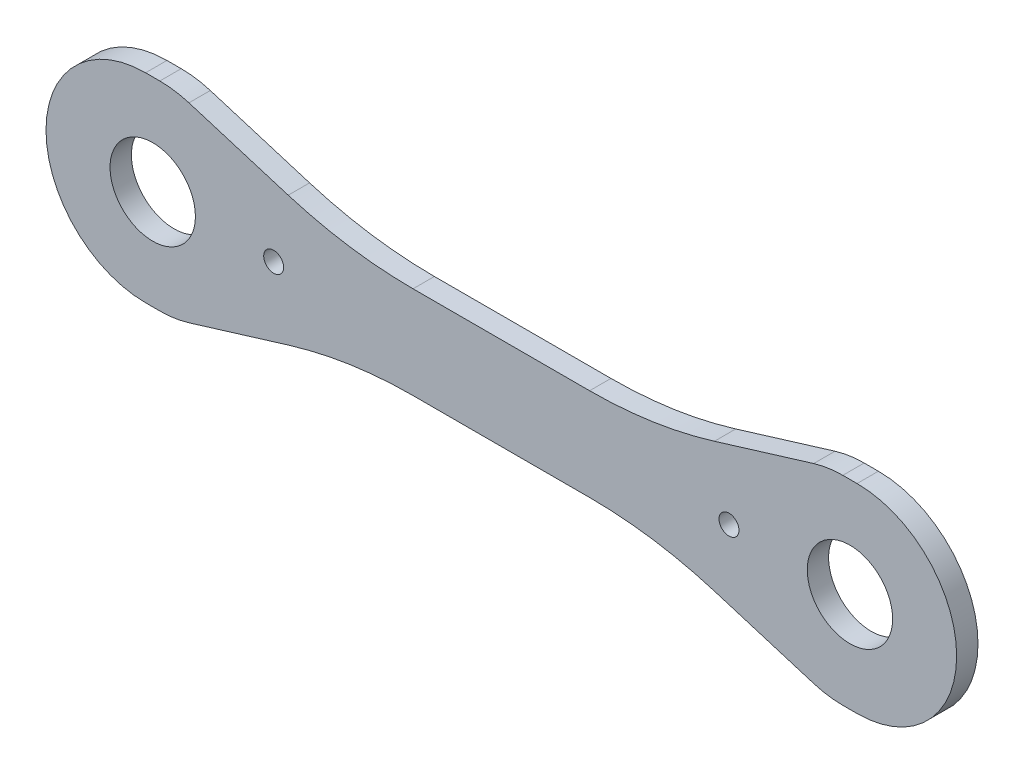
ISO-10303-21;
HEADER;
FILE_DESCRIPTION(('STEP AP214'),'2;1');
FILE_NAME('part.step','',(''),(''),'','','');
FILE_SCHEMA(('AUTOMOTIVE_DESIGN { 1 0 10303 214 1 1 1 1 }'));
ENDSEC;
DATA;
#1=APPLICATION_CONTEXT('core data for automotive mechanical design processes');
#2=APPLICATION_PROTOCOL_DEFINITION('international standard','automotive_design',2000,#1);
#3=PRODUCT_CONTEXT('',#1,'mechanical');
#4=PRODUCT('Part','Part','',(#3));
#5=PRODUCT_RELATED_PRODUCT_CATEGORY('part','',(#4));
#6=PRODUCT_DEFINITION_FORMATION('','',#4);
#7=PRODUCT_DEFINITION_CONTEXT('part definition',#1,'design');
#8=PRODUCT_DEFINITION('design','',#6,#7);
#9=PRODUCT_DEFINITION_SHAPE('','',#8);
#10=(LENGTH_UNIT() NAMED_UNIT(*) SI_UNIT(.MILLI.,.METRE.));
#11=(NAMED_UNIT(*) PLANE_ANGLE_UNIT() SI_UNIT($,.RADIAN.));
#12=(NAMED_UNIT(*) SI_UNIT($,.STERADIAN.) SOLID_ANGLE_UNIT());
#13=UNCERTAINTY_MEASURE_WITH_UNIT(LENGTH_MEASURE(1.E-05),#10,'distance_accuracy_value','');
#14=(GEOMETRIC_REPRESENTATION_CONTEXT(3) GLOBAL_UNCERTAINTY_ASSIGNED_CONTEXT((#13)) GLOBAL_UNIT_ASSIGNED_CONTEXT((#10,
#11,#12)) REPRESENTATION_CONTEXT('',''));
#15=CARTESIAN_POINT('',(0.,0.,0.));
#16=DIRECTION('',(0.,0.,1.));
#17=DIRECTION('',(1.,0.,0.));
#18=AXIS2_PLACEMENT_3D('',#15,#16,#17);
#19=CARTESIAN_POINT('',(-250.,0.,14.9999999999997));
#20=DIRECTION('',(0.,0.,-1.));
#21=DIRECTION('',(-1.,0.,0.));
#22=AXIS2_PLACEMENT_3D('',#19,#20,#21);
#23=CYLINDRICAL_SURFACE('',#22,70.);
#24=CARTESIAN_POINT('',(-250.,1.11022302462516E-13,-1.11022302462516E-13));
#25=DIRECTION('',(0.,0.,1.));
#26=DIRECTION('',(1.,0.,0.));
#27=AXIS2_PLACEMENT_3D('',#24,#25,#26);
#28=CIRCLE('',#27,70.);
#29=CARTESIAN_POINT('',(-250.,70.0000000000003,-1.11022302462516E-13));
#30=VERTEX_POINT('',#29);
#31=CARTESIAN_POINT('',(-250.,-70.0000000000001,-1.66533453693773E-13));
#32=VERTEX_POINT('',#31);
#33=EDGE_CURVE('E200',#30,#32,#28,.T.);
#34=ORIENTED_EDGE('',*,*,#33,.T.);
#35=DIRECTION('',(0.,0.,-1.));
#36=VECTOR('',#35,1.);
#37=CARTESIAN_POINT('',(-250.,-70.,14.9999999999997));
#38=LINE('',#37,#36);
#39=CARTESIAN_POINT('',(-250.,-70.,14.9999999999997));
#40=VERTEX_POINT('',#39);
#41=EDGE_CURVE('E11',#40,#32,#38,.T.);
#42=ORIENTED_EDGE('',*,*,#41,.F.);
#43=CARTESIAN_POINT('',(-250.,0.,14.9999999999997));
#44=DIRECTION('',(0.,0.,1.));
#45=DIRECTION('',(1.,0.,0.));
#46=AXIS2_PLACEMENT_3D('',#43,#44,#45);
#47=CIRCLE('',#46,70.);
#48=CARTESIAN_POINT('',(-250.,70.0000000000003,15.));
#49=VERTEX_POINT('',#48);
#50=EDGE_CURVE('E239',#49,#40,#47,.T.);
#51=ORIENTED_EDGE('',*,*,#50,.F.);
#52=DIRECTION('',(0.,0.,-1.));
#53=VECTOR('',#52,1.);
#54=CARTESIAN_POINT('',(-250.,70.0000000000003,15.));
#55=LINE('',#54,#53);
#56=EDGE_CURVE('E196',#49,#30,#55,.T.);
#57=ORIENTED_EDGE('',*,*,#56,.T.);
#58=EDGE_LOOP('',(#34,#42,#51,#57));
#59=FACE_BOUND('',#58,.T.);
#60=ADVANCED_FACE('F32',(#59),#23,.T.);
#61=CARTESIAN_POINT('',(-250.,-70.,14.9999999999997));
#62=DIRECTION('',(0.,1.,0.));
#63=DIRECTION('',(0.,0.,1.));
#64=AXIS2_PLACEMENT_3D('',#61,#62,#63);
#65=PLANE('',#64);
#66=DIRECTION('',(1.,0.,0.));
#67=VECTOR('',#66,1.);
#68=CARTESIAN_POINT('',(-250.,-70.0000000000001,-1.66533453693773E-13));
#69=LINE('',#68,#67);
#70=CARTESIAN_POINT('',(-240.,-70.0000000000001,-1.66533453693773E-13));
#71=VERTEX_POINT('',#70);
#72=EDGE_CURVE('E203',#32,#71,#69,.T.);
#73=ORIENTED_EDGE('',*,*,#72,.T.);
#74=DIRECTION('',(0.,0.,-1.));
#75=VECTOR('',#74,1.);
#76=CARTESIAN_POINT('',(-240.,-69.9999999999999,14.9999999999999));
#77=LINE('',#76,#75);
#78=CARTESIAN_POINT('',(-240.,-69.9999999999999,14.9999999999999));
#79=VERTEX_POINT('',#78);
#80=EDGE_CURVE('E40',#79,#71,#77,.T.);
#81=ORIENTED_EDGE('',*,*,#80,.F.);
#82=DIRECTION('',(1.,0.,0.));
#83=VECTOR('',#82,1.);
#84=CARTESIAN_POINT('',(-250.,-70.,14.9999999999997));
#85=LINE('',#84,#83);
#86=EDGE_CURVE('E127',#40,#79,#85,.T.);
#87=ORIENTED_EDGE('',*,*,#86,.F.);
#88=ORIENTED_EDGE('',*,*,#41,.T.);
#89=EDGE_LOOP('',(#73,#81,#87,#88));
#90=FACE_BOUND('',#89,.T.);
#91=ADVANCED_FACE('F358',(#90),#65,.F.);
#92=CARTESIAN_POINT('',(-240.,0.,14.9999999999999));
#93=DIRECTION('',(0.,0.,-1.));
#94=DIRECTION('',(-1.,0.,0.));
#95=AXIS2_PLACEMENT_3D('',#92,#93,#94);
#96=CYLINDRICAL_SURFACE('',#95,70.);
#97=CARTESIAN_POINT('',(-240.,1.11022302462516E-13,0.));
#98=DIRECTION('',(0.,0.,1.));
#99=DIRECTION('',(1.,0.,0.));
#100=AXIS2_PLACEMENT_3D('',#97,#98,#99);
#101=CIRCLE('',#100,70.);
#102=CARTESIAN_POINT('',(-219.533980669409,-66.9413329174125,-1.11022302462516E-13));
#103=VERTEX_POINT('',#102);
#104=EDGE_CURVE('E206',#71,#103,#101,.T.);
#105=ORIENTED_EDGE('',*,*,#104,.T.);
#106=DIRECTION('',(0.,0.,-1.));
#107=VECTOR('',#106,1.);
#108=CARTESIAN_POINT('',(-219.533980669409,-66.9413329174124,14.9999999999999));
#109=LINE('',#108,#107);
#110=CARTESIAN_POINT('',(-219.533980669409,-66.9413329174124,14.9999999999999));
#111=VERTEX_POINT('',#110);
#112=EDGE_CURVE('E282',#111,#103,#109,.T.);
#113=ORIENTED_EDGE('',*,*,#112,.F.);
#114=CARTESIAN_POINT('',(-240.,0.,14.9999999999999));
#115=DIRECTION('',(0.,0.,1.));
#116=DIRECTION('',(1.,0.,0.));
#117=AXIS2_PLACEMENT_3D('',#114,#115,#116);
#118=CIRCLE('',#117,70.);
#119=EDGE_CURVE('E290',#79,#111,#118,.T.);
#120=ORIENTED_EDGE('',*,*,#119,.F.);
#121=ORIENTED_EDGE('',*,*,#80,.T.);
#122=EDGE_LOOP('',(#105,#113,#120,#121));
#123=FACE_BOUND('',#122,.T.);
#124=ADVANCED_FACE('F288',(#123),#96,.T.);
#125=CARTESIAN_POINT('',(-219.533980669409,-66.9413329174124,14.9999999999999));
#126=DIRECTION('',(-0.29237170472274,0.956304755963036,0.));
#127=DIRECTION('',(-0.956304755963036,-0.29237170472274,0.));
#128=AXIS2_PLACEMENT_3D('',#125,#126,#127);
#129=PLANE('',#128);
#130=DIRECTION('',(0.956304755963036,0.29237170472274,0.));
#131=VECTOR('',#130,1.);
#132=CARTESIAN_POINT('',(-219.533980669409,-66.9413329174125,-1.11022302462516E-13));
#133=LINE('',#132,#131);
#134=CARTESIAN_POINT('',(-149.757667724489,-45.6085732110893,-1.66533453693773E-13));
#135=VERTEX_POINT('',#134);
#136=EDGE_CURVE('E208',#103,#135,#133,.T.);
#137=ORIENTED_EDGE('',*,*,#136,.T.);
#138=DIRECTION('',(0.,0.,-1.));
#139=VECTOR('',#138,1.);
#140=CARTESIAN_POINT('',(-149.757667724489,-45.6085732110894,14.9999999999998));
#141=LINE('',#140,#139);
#142=CARTESIAN_POINT('',(-149.757667724489,-45.6085732110894,14.9999999999998));
#143=VERTEX_POINT('',#142);
#144=EDGE_CURVE('E279',#143,#135,#141,.T.);
#145=ORIENTED_EDGE('',*,*,#144,.F.);
#146=DIRECTION('',(0.956304755963036,0.29237170472274,0.));
#147=VECTOR('',#146,1.);
#148=CARTESIAN_POINT('',(-219.533980669409,-66.9413329174124,14.9999999999999));
#149=LINE('',#148,#147);
#150=EDGE_CURVE('E308',#111,#143,#149,.T.);
#151=ORIENTED_EDGE('',*,*,#150,.F.);
#152=ORIENTED_EDGE('',*,*,#112,.T.);
#153=EDGE_LOOP('',(#137,#145,#151,#152));
#154=FACE_BOUND('',#153,.T.);
#155=ADVANCED_FACE('F299',(#154),#129,.F.);
#156=CARTESIAN_POINT('',(-62.0461563076674,-332.5,14.9999999999999));
#157=DIRECTION('',(0.,0.,-1.));
#158=DIRECTION('',(-1.,0.,0.));
#159=AXIS2_PLACEMENT_3D('',#156,#157,#158);
#160=CYLINDRICAL_SURFACE('',#159,300.);
#161=CARTESIAN_POINT('',(-62.0461563076673,-332.5,-1.11022302462516E-13));
#162=DIRECTION('',(0.,0.,-1.));
#163=DIRECTION('',(-1.,0.,0.));
#164=AXIS2_PLACEMENT_3D('',#161,#162,#163);
#165=CIRCLE('',#164,300.);
#166=CARTESIAN_POINT('',(-62.0461563076676,-32.4999999999999,-1.66533453693773E-13));
#167=VERTEX_POINT('',#166);
#168=EDGE_CURVE('E210',#135,#167,#165,.T.);
#169=ORIENTED_EDGE('',*,*,#168,.T.);
#170=DIRECTION('',(0.,0.,-1.));
#171=VECTOR('',#170,1.);
#172=CARTESIAN_POINT('',(-62.0461563076676,-32.4999999999999,14.9999999999999));
#173=LINE('',#172,#171);
#174=CARTESIAN_POINT('',(-62.0461563076676,-32.4999999999999,14.9999999999999));
#175=VERTEX_POINT('',#174);
#176=EDGE_CURVE('E276',#175,#167,#173,.T.);
#177=ORIENTED_EDGE('',*,*,#176,.F.);
#178=CARTESIAN_POINT('',(-62.0461563076674,-332.5,14.9999999999999));
#179=DIRECTION('',(0.,0.,-1.));
#180=DIRECTION('',(-1.,0.,0.));
#181=AXIS2_PLACEMENT_3D('',#178,#179,#180);
#182=CIRCLE('',#181,300.);
#183=EDGE_CURVE('E305',#143,#175,#182,.T.);
#184=ORIENTED_EDGE('',*,*,#183,.F.);
#185=ORIENTED_EDGE('',*,*,#144,.T.);
#186=EDGE_LOOP('',(#169,#177,#184,#185));
#187=FACE_BOUND('',#186,.T.);
#188=ADVANCED_FACE('F303',(#187),#160,.F.);
#189=CARTESIAN_POINT('',(-62.0461563076676,-32.4999999999999,14.9999999999999));
#190=DIRECTION('',(0.,1.,0.));
#191=DIRECTION('',(-1.,0.,0.));
#192=AXIS2_PLACEMENT_3D('',#189,#190,#191);
#193=PLANE('',#192);
#194=DIRECTION('',(1.,0.,0.));
#195=VECTOR('',#194,1.);
#196=CARTESIAN_POINT('',(-62.0461563076676,-32.4999999999999,-1.66533453693773E-13));
#197=LINE('',#196,#195);
#198=CARTESIAN_POINT('',(62.0461563076675,-32.4999999999999,-1.66533453693773E-13));
#199=VERTEX_POINT('',#198);
#200=EDGE_CURVE('E212',#167,#199,#197,.T.);
#201=ORIENTED_EDGE('',*,*,#200,.T.);
#202=DIRECTION('',(0.,0.,-1.));
#203=VECTOR('',#202,1.);
#204=CARTESIAN_POINT('',(62.0461563076675,-32.4999999999999,15.));
#205=LINE('',#204,#203);
#206=CARTESIAN_POINT('',(62.0461563076675,-32.4999999999999,15.));
#207=VERTEX_POINT('',#206);
#208=EDGE_CURVE('E273',#207,#199,#205,.T.);
#209=ORIENTED_EDGE('',*,*,#208,.F.);
#210=DIRECTION('',(1.,0.,0.));
#211=VECTOR('',#210,1.);
#212=CARTESIAN_POINT('',(-62.0461563076676,-32.4999999999999,14.9999999999999));
#213=LINE('',#212,#211);
#214=EDGE_CURVE('E307',#175,#207,#213,.T.);
#215=ORIENTED_EDGE('',*,*,#214,.F.);
#216=ORIENTED_EDGE('',*,*,#176,.T.);
#217=EDGE_LOOP('',(#201,#209,#215,#216));
#218=FACE_BOUND('',#217,.T.);
#219=ADVANCED_FACE('F371',(#218),#193,.F.);
#220=CARTESIAN_POINT('',(62.0461563076677,-332.5,15.));
#221=DIRECTION('',(0.,0.,-1.));
#222=DIRECTION('',(-1.,0.,0.));
#223=AXIS2_PLACEMENT_3D('',#220,#221,#222);
#224=CYLINDRICAL_SURFACE('',#223,300.);
#225=CARTESIAN_POINT('',(62.0461563076676,-332.5,0.));
#226=DIRECTION('',(0.,0.,-1.));
#227=DIRECTION('',(1.,0.,0.));
#228=AXIS2_PLACEMENT_3D('',#225,#226,#227);
#229=CIRCLE('',#228,300.);
#230=CARTESIAN_POINT('',(149.757667724489,-45.6085732110892,0.));
#231=VERTEX_POINT('',#230);
#232=EDGE_CURVE('E214',#199,#231,#229,.T.);
#233=ORIENTED_EDGE('',*,*,#232,.T.);
#234=DIRECTION('',(0.,0.,-1.));
#235=VECTOR('',#234,1.);
#236=CARTESIAN_POINT('',(149.757667724489,-45.6085732110892,14.9999999999999));
#237=LINE('',#236,#235);
#238=CARTESIAN_POINT('',(149.757667724489,-45.6085732110892,14.9999999999999));
#239=VERTEX_POINT('',#238);
#240=EDGE_CURVE('E270',#239,#231,#237,.T.);
#241=ORIENTED_EDGE('',*,*,#240,.F.);
#242=CARTESIAN_POINT('',(62.0461563076677,-332.5,15.));
#243=DIRECTION('',(0.,0.,-1.));
#244=DIRECTION('',(1.,0.,0.));
#245=AXIS2_PLACEMENT_3D('',#242,#243,#244);
#246=CIRCLE('',#245,300.);
#247=EDGE_CURVE('E310',#207,#239,#246,.T.);
#248=ORIENTED_EDGE('',*,*,#247,.F.);
#249=ORIENTED_EDGE('',*,*,#208,.T.);
#250=EDGE_LOOP('',(#233,#241,#248,#249));
#251=FACE_BOUND('',#250,.T.);
#252=ADVANCED_FACE('F374',(#251),#224,.F.);
#253=CARTESIAN_POINT('',(219.533980669408,-66.9413329174124,15.));
#254=DIRECTION('',(0.292371704722739,0.956304755963036,0.));
#255=DIRECTION('',(-0.956304755963036,0.29237170472274,0.));
#256=AXIS2_PLACEMENT_3D('',#253,#254,#255);
#257=PLANE('',#256);
#258=DIRECTION('',(0.956304755963036,-0.29237170472274,0.));
#259=VECTOR('',#258,1.);
#260=CARTESIAN_POINT('',(219.533980669409,-66.9413329174125,-1.11022302462516E-13));
#261=LINE('',#260,#259);
#262=CARTESIAN_POINT('',(219.533980669409,-66.9413329174125,-1.11022302462516E-13));
#263=VERTEX_POINT('',#262);
#264=EDGE_CURVE('E216',#231,#263,#261,.T.);
#265=ORIENTED_EDGE('',*,*,#264,.T.);
#266=DIRECTION('',(0.,0.,-1.));
#267=VECTOR('',#266,1.);
#268=CARTESIAN_POINT('',(219.533980669409,-66.9413329174124,15.));
#269=LINE('',#268,#267);
#270=CARTESIAN_POINT('',(219.533980669409,-66.9413329174124,15.));
#271=VERTEX_POINT('',#270);
#272=EDGE_CURVE('E267',#271,#263,#269,.T.);
#273=ORIENTED_EDGE('',*,*,#272,.F.);
#274=DIRECTION('',(0.956304755963036,-0.29237170472274,0.));
#275=VECTOR('',#274,1.);
#276=CARTESIAN_POINT('',(219.533980669408,-66.9413329174124,15.));
#277=LINE('',#276,#275);
#278=EDGE_CURVE('E316',#239,#271,#277,.T.);
#279=ORIENTED_EDGE('',*,*,#278,.F.);
#280=ORIENTED_EDGE('',*,*,#240,.T.);
#281=EDGE_LOOP('',(#265,#273,#279,#280));
#282=FACE_BOUND('',#281,.T.);
#283=ADVANCED_FACE('F378',(#282),#257,.F.);
#284=CARTESIAN_POINT('',(240.,0.,15.));
#285=DIRECTION('',(0.,0.,-1.));
#286=DIRECTION('',(-1.,0.,0.));
#287=AXIS2_PLACEMENT_3D('',#284,#285,#286);
#288=CYLINDRICAL_SURFACE('',#287,69.9999999999999);
#289=CARTESIAN_POINT('',(240.,0.,0.));
#290=DIRECTION('',(0.,0.,1.));
#291=DIRECTION('',(-1.,0.,0.));
#292=AXIS2_PLACEMENT_3D('',#289,#290,#291);
#293=CIRCLE('',#292,69.9999999999999);
#294=CARTESIAN_POINT('',(240.,-70.,0.));
#295=VERTEX_POINT('',#294);
#296=EDGE_CURVE('E218',#263,#295,#293,.T.);
#297=ORIENTED_EDGE('',*,*,#296,.T.);
#298=DIRECTION('',(0.,0.,-1.));
#299=VECTOR('',#298,1.);
#300=CARTESIAN_POINT('',(240.,-70.,15.));
#301=LINE('',#300,#299);
#302=CARTESIAN_POINT('',(240.,-70.,15.));
#303=VERTEX_POINT('',#302);
#304=EDGE_CURVE('E264',#303,#295,#301,.T.);
#305=ORIENTED_EDGE('',*,*,#304,.F.);
#306=CARTESIAN_POINT('',(240.,0.,15.));
#307=DIRECTION('',(0.,0.,1.));
#308=DIRECTION('',(-1.,0.,0.));
#309=AXIS2_PLACEMENT_3D('',#306,#307,#308);
#310=CIRCLE('',#309,69.9999999999999);
#311=EDGE_CURVE('E318',#271,#303,#310,.T.);
#312=ORIENTED_EDGE('',*,*,#311,.F.);
#313=ORIENTED_EDGE('',*,*,#272,.T.);
#314=EDGE_LOOP('',(#297,#305,#312,#313));
#315=FACE_BOUND('',#314,.T.);
#316=ADVANCED_FACE('F382',(#315),#288,.T.);
#317=CARTESIAN_POINT('',(250.,-70.,15.));
#318=DIRECTION('',(0.,1.,0.));
#319=DIRECTION('',(0.,0.,1.));
#320=AXIS2_PLACEMENT_3D('',#317,#318,#319);
#321=PLANE('',#320);
#322=DIRECTION('',(1.,0.,0.));
#323=VECTOR('',#322,1.);
#324=CARTESIAN_POINT('',(250.,-69.9999999999999,0.));
#325=LINE('',#324,#323);
#326=CARTESIAN_POINT('',(250.,-70.,0.));
#327=VERTEX_POINT('',#326);
#328=EDGE_CURVE('E220',#295,#327,#325,.T.);
#329=ORIENTED_EDGE('',*,*,#328,.T.);
#330=DIRECTION('',(0.,0.,-1.));
#331=VECTOR('',#330,1.);
#332=CARTESIAN_POINT('',(250.,-70.,15.));
#333=LINE('',#332,#331);
#334=CARTESIAN_POINT('',(250.,-70.,15.));
#335=VERTEX_POINT('',#334);
#336=EDGE_CURVE('E261',#335,#327,#333,.T.);
#337=ORIENTED_EDGE('',*,*,#336,.F.);
#338=DIRECTION('',(1.,0.,0.));
#339=VECTOR('',#338,1.);
#340=CARTESIAN_POINT('',(250.,-70.,15.));
#341=LINE('',#340,#339);
#342=EDGE_CURVE('E320',#303,#335,#341,.T.);
#343=ORIENTED_EDGE('',*,*,#342,.F.);
#344=ORIENTED_EDGE('',*,*,#304,.T.);
#345=EDGE_LOOP('',(#329,#337,#343,#344));
#346=FACE_BOUND('',#345,.T.);
#347=ADVANCED_FACE('F386',(#346),#321,.F.);
#348=CARTESIAN_POINT('',(250.,0.,15.));
#349=DIRECTION('',(0.,0.,-1.));
#350=DIRECTION('',(-1.,0.,0.));
#351=AXIS2_PLACEMENT_3D('',#348,#349,#350);
#352=CYLINDRICAL_SURFACE('',#351,70.);
#353=CARTESIAN_POINT('',(250.,0.,-1.11022302462516E-13));
#354=DIRECTION('',(0.,0.,1.));
#355=DIRECTION('',(-1.,0.,0.));
#356=AXIS2_PLACEMENT_3D('',#353,#354,#355);
#357=CIRCLE('',#356,70.);
#358=CARTESIAN_POINT('',(250.,70.0000000000001,0.));
#359=VERTEX_POINT('',#358);
#360=EDGE_CURVE('E222',#327,#359,#357,.T.);
#361=ORIENTED_EDGE('',*,*,#360,.T.);
#362=DIRECTION('',(0.,0.,-1.));
#363=VECTOR('',#362,1.);
#364=CARTESIAN_POINT('',(250.,70.0000000000001,15.));
#365=LINE('',#364,#363);
#366=CARTESIAN_POINT('',(250.,70.0000000000001,15.));
#367=VERTEX_POINT('',#366);
#368=EDGE_CURVE('E258',#367,#359,#365,.T.);
#369=ORIENTED_EDGE('',*,*,#368,.F.);
#370=CARTESIAN_POINT('',(250.,0.,15.));
#371=DIRECTION('',(0.,0.,1.));
#372=DIRECTION('',(-1.,0.,0.));
#373=AXIS2_PLACEMENT_3D('',#370,#371,#372);
#374=CIRCLE('',#373,70.);
#375=EDGE_CURVE('E322',#335,#367,#374,.T.);
#376=ORIENTED_EDGE('',*,*,#375,.F.);
#377=ORIENTED_EDGE('',*,*,#336,.T.);
#378=EDGE_LOOP('',(#361,#369,#376,#377));
#379=FACE_BOUND('',#378,.T.);
#380=ADVANCED_FACE('F390',(#379),#352,.T.);
#381=CARTESIAN_POINT('',(250.,70.0000000000001,15.));
#382=DIRECTION('',(0.,-1.,0.));
#383=DIRECTION('',(0.,0.,-1.));
#384=AXIS2_PLACEMENT_3D('',#381,#382,#383);
#385=PLANE('',#384);
#386=DIRECTION('',(-1.,0.,0.));
#387=VECTOR('',#386,1.);
#388=CARTESIAN_POINT('',(250.,70.0000000000001,0.));
#389=LINE('',#388,#387);
#390=CARTESIAN_POINT('',(240.,70.0000000000001,0.));
#391=VERTEX_POINT('',#390);
#392=EDGE_CURVE('E224',#359,#391,#389,.T.);
#393=ORIENTED_EDGE('',*,*,#392,.T.);
#394=DIRECTION('',(0.,0.,-1.));
#395=VECTOR('',#394,1.);
#396=CARTESIAN_POINT('',(240.,70.0000000000001,15.));
#397=LINE('',#396,#395);
#398=CARTESIAN_POINT('',(240.,70.0000000000001,15.));
#399=VERTEX_POINT('',#398);
#400=EDGE_CURVE('E255',#399,#391,#397,.T.);
#401=ORIENTED_EDGE('',*,*,#400,.F.);
#402=DIRECTION('',(-1.,0.,0.));
#403=VECTOR('',#402,1.);
#404=CARTESIAN_POINT('',(250.,70.0000000000001,15.));
#405=LINE('',#404,#403);
#406=EDGE_CURVE('E324',#367,#399,#405,.T.);
#407=ORIENTED_EDGE('',*,*,#406,.F.);
#408=ORIENTED_EDGE('',*,*,#368,.T.);
#409=EDGE_LOOP('',(#393,#401,#407,#408));
#410=FACE_BOUND('',#409,.T.);
#411=ADVANCED_FACE('F394',(#410),#385,.F.);
#412=CARTESIAN_POINT('',(240.,0.,15.));
#413=DIRECTION('',(0.,0.,-1.));
#414=DIRECTION('',(-1.,0.,0.));
#415=AXIS2_PLACEMENT_3D('',#412,#413,#414);
#416=CYLINDRICAL_SURFACE('',#415,70.);
#417=CARTESIAN_POINT('',(240.,0.,0.));
#418=DIRECTION('',(0.,0.,1.));
#419=DIRECTION('',(1.,0.,0.));
#420=AXIS2_PLACEMENT_3D('',#417,#418,#419);
#421=CIRCLE('',#420,70.);
#422=CARTESIAN_POINT('',(219.533980669409,66.9413329174126,0.));
#423=VERTEX_POINT('',#422);
#424=EDGE_CURVE('E226',#391,#423,#421,.T.);
#425=ORIENTED_EDGE('',*,*,#424,.T.);
#426=DIRECTION('',(0.,0.,-1.));
#427=VECTOR('',#426,1.);
#428=CARTESIAN_POINT('',(219.533980669409,66.9413329174126,15.));
#429=LINE('',#428,#427);
#430=CARTESIAN_POINT('',(219.533980669409,66.9413329174126,15.));
#431=VERTEX_POINT('',#430);
#432=EDGE_CURVE('E252',#431,#423,#429,.T.);
#433=ORIENTED_EDGE('',*,*,#432,.F.);
#434=CARTESIAN_POINT('',(240.,0.,15.));
#435=DIRECTION('',(0.,0.,1.));
#436=DIRECTION('',(1.,0.,0.));
#437=AXIS2_PLACEMENT_3D('',#434,#435,#436);
#438=CIRCLE('',#437,70.);
#439=EDGE_CURVE('E326',#399,#431,#438,.T.);
#440=ORIENTED_EDGE('',*,*,#439,.F.);
#441=ORIENTED_EDGE('',*,*,#400,.T.);
#442=EDGE_LOOP('',(#425,#433,#440,#441));
#443=FACE_BOUND('',#442,.T.);
#444=ADVANCED_FACE('F398',(#443),#416,.T.);
#445=CARTESIAN_POINT('',(219.533980669409,66.9413329174126,15.));
#446=DIRECTION('',(0.29237170472274,-0.956304755963036,0.));
#447=DIRECTION('',(0.956304755963036,0.292371704722739,0.));
#448=AXIS2_PLACEMENT_3D('',#445,#446,#447);
#449=PLANE('',#448);
#450=DIRECTION('',(-0.956304755963036,-0.292371704722739,0.));
#451=VECTOR('',#450,1.);
#452=CARTESIAN_POINT('',(219.533980669409,66.9413329174126,0.));
#453=LINE('',#452,#451);
#454=CARTESIAN_POINT('',(149.757667724489,45.6085732110896,-1.11022302462516E-13));
#455=VERTEX_POINT('',#454);
#456=EDGE_CURVE('E228',#423,#455,#453,.T.);
#457=ORIENTED_EDGE('',*,*,#456,.T.);
#458=DIRECTION('',(0.,0.,-1.));
#459=VECTOR('',#458,1.);
#460=CARTESIAN_POINT('',(149.757667724489,45.6085732110896,15.));
#461=LINE('',#460,#459);
#462=CARTESIAN_POINT('',(149.757667724489,45.6085732110896,15.));
#463=VERTEX_POINT('',#462);
#464=EDGE_CURVE('E249',#463,#455,#461,.T.);
#465=ORIENTED_EDGE('',*,*,#464,.F.);
#466=DIRECTION('',(-0.956304755963036,-0.292371704722739,0.));
#467=VECTOR('',#466,1.);
#468=CARTESIAN_POINT('',(219.533980669409,66.9413329174126,15.));
#469=LINE('',#468,#467);
#470=EDGE_CURVE('E328',#431,#463,#469,.T.);
#471=ORIENTED_EDGE('',*,*,#470,.F.);
#472=ORIENTED_EDGE('',*,*,#432,.T.);
#473=EDGE_LOOP('',(#457,#465,#471,#472));
#474=FACE_BOUND('',#473,.T.);
#475=ADVANCED_FACE('F402',(#474),#449,.F.);
#476=CARTESIAN_POINT('',(62.0461563076675,332.5,14.9999999999998));
#477=DIRECTION('',(0.,0.,-1.));
#478=DIRECTION('',(-1.,0.,0.));
#479=AXIS2_PLACEMENT_3D('',#476,#477,#478);
#480=CYLINDRICAL_SURFACE('',#479,300.);
#481=CARTESIAN_POINT('',(62.0461563076675,332.5,-1.11022302462516E-13));
#482=DIRECTION('',(0.,0.,-1.));
#483=DIRECTION('',(-1.,0.,0.));
#484=AXIS2_PLACEMENT_3D('',#481,#482,#483);
#485=CIRCLE('',#484,300.);
#486=CARTESIAN_POINT('',(62.0461563076675,32.5,0.));
#487=VERTEX_POINT('',#486);
#488=EDGE_CURVE('E230',#455,#487,#485,.T.);
#489=ORIENTED_EDGE('',*,*,#488,.T.);
#490=DIRECTION('',(0.,0.,-1.));
#491=VECTOR('',#490,1.);
#492=CARTESIAN_POINT('',(62.0461563076675,32.5000000000001,14.9999999999999));
#493=LINE('',#492,#491);
#494=CARTESIAN_POINT('',(62.0461563076675,32.5000000000001,14.9999999999999));
#495=VERTEX_POINT('',#494);
#496=EDGE_CURVE('E246',#495,#487,#493,.T.);
#497=ORIENTED_EDGE('',*,*,#496,.F.);
#498=CARTESIAN_POINT('',(62.0461563076675,332.5,14.9999999999998));
#499=DIRECTION('',(0.,0.,-1.));
#500=DIRECTION('',(-1.,0.,0.));
#501=AXIS2_PLACEMENT_3D('',#498,#499,#500);
#502=CIRCLE('',#501,300.);
#503=EDGE_CURVE('E330',#463,#495,#502,.T.);
#504=ORIENTED_EDGE('',*,*,#503,.F.);
#505=ORIENTED_EDGE('',*,*,#464,.T.);
#506=EDGE_LOOP('',(#489,#497,#504,#505));
#507=FACE_BOUND('',#506,.T.);
#508=ADVANCED_FACE('F406',(#507),#480,.F.);
#509=CARTESIAN_POINT('',(-62.0461563076675,32.5000000000001,14.9999999999999));
#510=DIRECTION('',(0.,-1.,0.));
#511=DIRECTION('',(0.,0.,-1.));
#512=AXIS2_PLACEMENT_3D('',#509,#510,#511);
#513=PLANE('',#512);
#514=DIRECTION('',(-1.,0.,0.));
#515=VECTOR('',#514,1.);
#516=CARTESIAN_POINT('',(-62.0461563076675,32.5000000000001,-1.11022302462516E-13));
#517=LINE('',#516,#515);
#518=CARTESIAN_POINT('',(-62.0461563076676,32.5,-1.11022302462516E-13));
#519=VERTEX_POINT('',#518);
#520=EDGE_CURVE('E232',#487,#519,#517,.T.);
#521=ORIENTED_EDGE('',*,*,#520,.T.);
#522=DIRECTION('',(0.,0.,-1.));
#523=VECTOR('',#522,1.);
#524=CARTESIAN_POINT('',(-62.0461563076676,32.5000000000001,14.9999999999998));
#525=LINE('',#524,#523);
#526=CARTESIAN_POINT('',(-62.0461563076676,32.5000000000001,14.9999999999998));
#527=VERTEX_POINT('',#526);
#528=EDGE_CURVE('E243',#527,#519,#525,.T.);
#529=ORIENTED_EDGE('',*,*,#528,.F.);
#530=DIRECTION('',(-1.,0.,0.));
#531=VECTOR('',#530,1.);
#532=CARTESIAN_POINT('',(-62.0461563076675,32.5000000000001,14.9999999999999));
#533=LINE('',#532,#531);
#534=EDGE_CURVE('E332',#495,#527,#533,.T.);
#535=ORIENTED_EDGE('',*,*,#534,.F.);
#536=ORIENTED_EDGE('',*,*,#496,.T.);
#537=EDGE_LOOP('',(#521,#529,#535,#536));
#538=FACE_BOUND('',#537,.T.);
#539=ADVANCED_FACE('F338',(#538),#513,.F.);
#540=CARTESIAN_POINT('',(-62.0461563076677,332.5,15.));
#541=DIRECTION('',(0.,0.,-1.));
#542=DIRECTION('',(-1.,0.,0.));
#543=AXIS2_PLACEMENT_3D('',#540,#541,#542);
#544=CYLINDRICAL_SURFACE('',#543,300.);
#545=CARTESIAN_POINT('',(-62.0461563076678,332.5,0.));
#546=DIRECTION('',(0.,0.,-1.));
#547=DIRECTION('',(1.,0.,0.));
#548=AXIS2_PLACEMENT_3D('',#545,#546,#547);
#549=CIRCLE('',#548,300.);
#550=CARTESIAN_POINT('',(-149.757667724489,45.6085732110894,0.));
#551=VERTEX_POINT('',#550);
#552=EDGE_CURVE('E234',#519,#551,#549,.T.);
#553=ORIENTED_EDGE('',*,*,#552,.T.);
#554=DIRECTION('',(0.,0.,-1.));
#555=VECTOR('',#554,1.);
#556=CARTESIAN_POINT('',(-149.757667724489,45.6085732110895,14.9999999999998));
#557=LINE('',#556,#555);
#558=CARTESIAN_POINT('',(-149.757667724489,45.6085732110895,14.9999999999998));
#559=VERTEX_POINT('',#558);
#560=EDGE_CURVE('E191',#559,#551,#557,.T.);
#561=ORIENTED_EDGE('',*,*,#560,.F.);
#562=CARTESIAN_POINT('',(-62.0461563076677,332.5,15.));
#563=DIRECTION('',(0.,0.,-1.));
#564=DIRECTION('',(1.,0.,0.));
#565=AXIS2_PLACEMENT_3D('',#562,#563,#564);
#566=CIRCLE('',#565,300.);
#567=EDGE_CURVE('E182',#527,#559,#566,.T.);
#568=ORIENTED_EDGE('',*,*,#567,.F.);
#569=ORIENTED_EDGE('',*,*,#528,.T.);
#570=EDGE_LOOP('',(#553,#561,#568,#569));
#571=FACE_BOUND('',#570,.T.);
#572=ADVANCED_FACE('F342',(#571),#544,.F.);
#573=CARTESIAN_POINT('',(-219.533980669409,66.9413329174127,15.));
#574=DIRECTION('',(-0.292371704722738,-0.956304755963036,0.));
#575=DIRECTION('',(0.956304755963036,-0.292371704722739,0.));
#576=AXIS2_PLACEMENT_3D('',#573,#574,#575);
#577=PLANE('',#576);
#578=DIRECTION('',(-0.956304755963036,0.292371704722739,0.));
#579=VECTOR('',#578,1.);
#580=CARTESIAN_POINT('',(-219.533980669409,66.9413329174127,0.));
#581=LINE('',#580,#579);
#582=CARTESIAN_POINT('',(-219.533980669409,66.9413329174127,0.));
#583=VERTEX_POINT('',#582);
#584=EDGE_CURVE('E190',#551,#583,#581,.T.);
#585=ORIENTED_EDGE('',*,*,#584,.T.);
#586=DIRECTION('',(0.,0.,-1.));
#587=VECTOR('',#586,1.);
#588=CARTESIAN_POINT('',(-219.533980669409,66.9413329174127,15.));
#589=LINE('',#588,#587);
#590=CARTESIAN_POINT('',(-219.533980669409,66.9413329174127,15.));
#591=VERTEX_POINT('',#590);
#592=EDGE_CURVE('E187',#591,#583,#589,.T.);
#593=ORIENTED_EDGE('',*,*,#592,.F.);
#594=DIRECTION('',(-0.956304755963036,0.292371704722739,0.));
#595=VECTOR('',#594,1.);
#596=CARTESIAN_POINT('',(-219.533980669409,66.9413329174127,15.));
#597=LINE('',#596,#595);
#598=EDGE_CURVE('E176',#559,#591,#597,.T.);
#599=ORIENTED_EDGE('',*,*,#598,.F.);
#600=ORIENTED_EDGE('',*,*,#560,.T.);
#601=EDGE_LOOP('',(#585,#593,#599,#600));
#602=FACE_BOUND('',#601,.T.);
#603=ADVANCED_FACE('F188',(#602),#577,.F.);
#604=CARTESIAN_POINT('',(-240.,0.,14.9999999999999));
#605=DIRECTION('',(0.,0.,-1.));
#606=DIRECTION('',(-1.,0.,0.));
#607=AXIS2_PLACEMENT_3D('',#604,#605,#606);
#608=CYLINDRICAL_SURFACE('',#607,70.);
#609=CARTESIAN_POINT('',(-240.,1.11022302462516E-13,0.));
#610=DIRECTION('',(0.,0.,1.));
#611=DIRECTION('',(-1.,0.,0.));
#612=AXIS2_PLACEMENT_3D('',#609,#610,#611);
#613=CIRCLE('',#612,70.);
#614=CARTESIAN_POINT('',(-240.,70.0000000000002,0.));
#615=VERTEX_POINT('',#614);
#616=EDGE_CURVE('E113',#583,#615,#613,.T.);
#617=ORIENTED_EDGE('',*,*,#616,.T.);
#618=DIRECTION('',(0.,0.,-1.));
#619=VECTOR('',#618,1.);
#620=CARTESIAN_POINT('',(-240.,70.0000000000001,14.9999999999997));
#621=LINE('',#620,#619);
#622=CARTESIAN_POINT('',(-240.,70.0000000000001,14.9999999999997));
#623=VERTEX_POINT('',#622);
#624=EDGE_CURVE('E192',#623,#615,#621,.T.);
#625=ORIENTED_EDGE('',*,*,#624,.F.);
#626=CARTESIAN_POINT('',(-240.,0.,14.9999999999999));
#627=DIRECTION('',(0.,0.,1.));
#628=DIRECTION('',(-1.,0.,0.));
#629=AXIS2_PLACEMENT_3D('',#626,#627,#628);
#630=CIRCLE('',#629,70.);
#631=EDGE_CURVE('E180',#591,#623,#630,.T.);
#632=ORIENTED_EDGE('',*,*,#631,.F.);
#633=ORIENTED_EDGE('',*,*,#592,.T.);
#634=EDGE_LOOP('',(#617,#625,#632,#633));
#635=FACE_BOUND('',#634,.T.);
#636=ADVANCED_FACE('F194',(#635),#608,.T.);
#637=CARTESIAN_POINT('',(-250.,70.0000000000003,15.));
#638=DIRECTION('',(0.,-1.,0.));
#639=DIRECTION('',(0.,0.,-1.));
#640=AXIS2_PLACEMENT_3D('',#637,#638,#639);
#641=PLANE('',#640);
#642=DIRECTION('',(-1.,0.,0.));
#643=VECTOR('',#642,1.);
#644=CARTESIAN_POINT('',(-250.,70.0000000000003,-1.11022302462516E-13));
#645=LINE('',#644,#643);
#646=EDGE_CURVE('E119',#615,#30,#645,.T.);
#647=ORIENTED_EDGE('',*,*,#646,.T.);
#648=ORIENTED_EDGE('',*,*,#56,.F.);
#649=DIRECTION('',(-1.,0.,0.));
#650=VECTOR('',#649,1.);
#651=CARTESIAN_POINT('',(-250.,70.0000000000003,15.));
#652=LINE('',#651,#650);
#653=EDGE_CURVE('E48',#623,#49,#652,.T.);
#654=ORIENTED_EDGE('',*,*,#653,.F.);
#655=ORIENTED_EDGE('',*,*,#624,.T.);
#656=EDGE_LOOP('',(#647,#648,#654,#655));
#657=FACE_BOUND('',#656,.T.);
#658=ADVANCED_FACE('F346',(#657),#641,.F.);
#659=CARTESIAN_POINT('',(-250.,0.,14.9999999999997));
#660=DIRECTION('',(0.,0.,1.));
#661=DIRECTION('',(1.,0.,0.));
#662=AXIS2_PLACEMENT_3D('',#659,#660,#661);
#663=PLANE('',#662);
#664=CARTESIAN_POINT('',(-160.,0.,14.9999999999999));
#665=DIRECTION('',(0.,0.,1.));
#666=DIRECTION('',(1.,0.,0.));
#667=AXIS2_PLACEMENT_3D('',#664,#665,#666);
#668=CIRCLE('',#667,7.00000000000001);
#669=CARTESIAN_POINT('',(-153.,0.,14.9999999999999));
#670=VERTEX_POINT('',#669);
#671=EDGE_CURVE('E492',#670,#670,#668,.T.);
#672=ORIENTED_EDGE('',*,*,#671,.F.);
#673=EDGE_LOOP('',(#672));
#674=FACE_BOUND('',#673,.T.);
#675=CARTESIAN_POINT('',(160.,0.,14.9999999999999));
#676=DIRECTION('',(0.,0.,1.));
#677=DIRECTION('',(1.,0.,0.));
#678=AXIS2_PLACEMENT_3D('',#675,#676,#677);
#679=CIRCLE('',#678,7.00000000000001);
#680=CARTESIAN_POINT('',(167.,0.,14.9999999999999));
#681=VERTEX_POINT('',#680);
#682=EDGE_CURVE('E494',#681,#681,#679,.T.);
#683=ORIENTED_EDGE('',*,*,#682,.F.);
#684=EDGE_LOOP('',(#683));
#685=FACE_BOUND('',#684,.T.);
#686=CARTESIAN_POINT('',(-245.,0.,14.9999999999999));
#687=DIRECTION('',(0.,0.,1.));
#688=DIRECTION('',(1.,0.,0.));
#689=AXIS2_PLACEMENT_3D('',#686,#687,#688);
#690=CIRCLE('',#689,30.);
#691=CARTESIAN_POINT('',(-215.,0.,14.9999999999999));
#692=VERTEX_POINT('',#691);
#693=EDGE_CURVE('E500',#692,#692,#690,.T.);
#694=ORIENTED_EDGE('',*,*,#693,.F.);
#695=EDGE_LOOP('',(#694));
#696=FACE_BOUND('',#695,.T.);
#697=CARTESIAN_POINT('',(245.,0.,15.));
#698=DIRECTION('',(0.,0.,1.));
#699=DIRECTION('',(1.,0.,0.));
#700=AXIS2_PLACEMENT_3D('',#697,#698,#699);
#701=CIRCLE('',#700,30.0000000000001);
#702=CARTESIAN_POINT('',(275.,0.,15.));
#703=VERTEX_POINT('',#702);
#704=EDGE_CURVE('E506',#703,#703,#701,.T.);
#705=ORIENTED_EDGE('',*,*,#704,.F.);
#706=EDGE_LOOP('',(#705));
#707=FACE_BOUND('',#706,.T.);
#708=ORIENTED_EDGE('',*,*,#50,.T.);
#709=ORIENTED_EDGE('',*,*,#86,.T.);
#710=ORIENTED_EDGE('',*,*,#119,.T.);
#711=ORIENTED_EDGE('',*,*,#150,.T.);
#712=ORIENTED_EDGE('',*,*,#183,.T.);
#713=ORIENTED_EDGE('',*,*,#214,.T.);
#714=ORIENTED_EDGE('',*,*,#247,.T.);
#715=ORIENTED_EDGE('',*,*,#278,.T.);
#716=ORIENTED_EDGE('',*,*,#311,.T.);
#717=ORIENTED_EDGE('',*,*,#342,.T.);
#718=ORIENTED_EDGE('',*,*,#375,.T.);
#719=ORIENTED_EDGE('',*,*,#406,.T.);
#720=ORIENTED_EDGE('',*,*,#439,.T.);
#721=ORIENTED_EDGE('',*,*,#470,.T.);
#722=ORIENTED_EDGE('',*,*,#503,.T.);
#723=ORIENTED_EDGE('',*,*,#534,.T.);
#724=ORIENTED_EDGE('',*,*,#567,.T.);
#725=ORIENTED_EDGE('',*,*,#598,.T.);
#726=ORIENTED_EDGE('',*,*,#631,.T.);
#727=ORIENTED_EDGE('',*,*,#653,.T.);
#728=EDGE_LOOP('',(#708,#709,#710,#711,#712,#713,#714,#715,#716,#717,#718,#719,#720,#721,#722,
#723,#724,#725,#726,#727));
#729=FACE_BOUND('',#728,.T.);
#730=ADVANCED_FACE('F178',(#674,#685,#696,#707,#729),#663,.T.);
#731=CARTESIAN_POINT('',(-250.,1.11022302462516E-13,-1.11022302462516E-13));
#732=DIRECTION('',(0.,0.,1.));
#733=DIRECTION('',(1.,0.,0.));
#734=AXIS2_PLACEMENT_3D('',#731,#732,#733);
#735=PLANE('',#734);
#736=CARTESIAN_POINT('',(-160.,1.11022302462516E-13,0.));
#737=DIRECTION('',(0.,0.,1.));
#738=DIRECTION('',(1.,0.,0.));
#739=AXIS2_PLACEMENT_3D('',#736,#737,#738);
#740=CIRCLE('',#739,7.00000000000001);
#741=CARTESIAN_POINT('',(-153.,1.0946799022804E-13,0.));
#742=VERTEX_POINT('',#741);
#743=EDGE_CURVE('E489',#742,#742,#740,.T.);
#744=ORIENTED_EDGE('',*,*,#743,.T.);
#745=EDGE_LOOP('',(#744));
#746=FACE_BOUND('',#745,.T.);
#747=CARTESIAN_POINT('',(160.,0.,-1.66533453693773E-13));
#748=DIRECTION('',(0.,0.,1.));
#749=DIRECTION('',(1.,0.,0.));
#750=AXIS2_PLACEMENT_3D('',#747,#748,#749);
#751=CIRCLE('',#750,7.00000000000001);
#752=CARTESIAN_POINT('',(167.,0.,-1.64201985342061E-13));
#753=VERTEX_POINT('',#752);
#754=EDGE_CURVE('E497',#753,#753,#751,.T.);
#755=ORIENTED_EDGE('',*,*,#754,.T.);
#756=EDGE_LOOP('',(#755));
#757=FACE_BOUND('',#756,.T.);
#758=CARTESIAN_POINT('',(-245.,1.11022302462516E-13,-1.11022302462516E-13));
#759=DIRECTION('',(0.,0.,1.));
#760=DIRECTION('',(1.,0.,0.));
#761=AXIS2_PLACEMENT_3D('',#758,#759,#760);
#762=CIRCLE('',#761,30.);
#763=CARTESIAN_POINT('',(-215.,1.04360964314765E-13,-1.01030295240889E-13));
#764=VERTEX_POINT('',#763);
#765=EDGE_CURVE('E503',#764,#764,#762,.T.);
#766=ORIENTED_EDGE('',*,*,#765,.T.);
#767=EDGE_LOOP('',(#766));
#768=FACE_BOUND('',#767,.T.);
#769=CARTESIAN_POINT('',(245.,0.,0.));
#770=DIRECTION('',(0.,0.,1.));
#771=DIRECTION('',(1.,0.,0.));
#772=AXIS2_PLACEMENT_3D('',#769,#770,#771);
#773=CIRCLE('',#772,30.0000000000001);
#774=CARTESIAN_POINT('',(275.,0.,0.));
#775=VERTEX_POINT('',#774);
#776=EDGE_CURVE('E204',#775,#775,#773,.T.);
#777=ORIENTED_EDGE('',*,*,#776,.T.);
#778=EDGE_LOOP('',(#777));
#779=FACE_BOUND('',#778,.T.);
#780=ORIENTED_EDGE('',*,*,#33,.F.);
#781=ORIENTED_EDGE('',*,*,#646,.F.);
#782=ORIENTED_EDGE('',*,*,#616,.F.);
#783=ORIENTED_EDGE('',*,*,#584,.F.);
#784=ORIENTED_EDGE('',*,*,#552,.F.);
#785=ORIENTED_EDGE('',*,*,#520,.F.);
#786=ORIENTED_EDGE('',*,*,#488,.F.);
#787=ORIENTED_EDGE('',*,*,#456,.F.);
#788=ORIENTED_EDGE('',*,*,#424,.F.);
#789=ORIENTED_EDGE('',*,*,#392,.F.);
#790=ORIENTED_EDGE('',*,*,#360,.F.);
#791=ORIENTED_EDGE('',*,*,#328,.F.);
#792=ORIENTED_EDGE('',*,*,#296,.F.);
#793=ORIENTED_EDGE('',*,*,#264,.F.);
#794=ORIENTED_EDGE('',*,*,#232,.F.);
#795=ORIENTED_EDGE('',*,*,#200,.F.);
#796=ORIENTED_EDGE('',*,*,#168,.F.);
#797=ORIENTED_EDGE('',*,*,#136,.F.);
#798=ORIENTED_EDGE('',*,*,#104,.F.);
#799=ORIENTED_EDGE('',*,*,#72,.F.);
#800=EDGE_LOOP('',(#780,#781,#782,#783,#784,#785,#786,#787,#788,#789,#790,#791,#792,#793,#794,
#795,#796,#797,#798,#799));
#801=FACE_BOUND('',#800,.T.);
#802=ADVANCED_FACE('F294',(#746,#757,#768,#779,#801),#735,.F.);
#803=CARTESIAN_POINT('',(245.,0.,0.));
#804=DIRECTION('',(0.,0.,1.));
#805=DIRECTION('',(1.,0.,0.));
#806=AXIS2_PLACEMENT_3D('',#803,#804,#805);
#807=CYLINDRICAL_SURFACE('',#806,30.0000000000001);
#808=ORIENTED_EDGE('',*,*,#776,.F.);
#809=EDGE_LOOP('',(#808));
#810=FACE_BOUND('',#809,.T.);
#811=ORIENTED_EDGE('',*,*,#704,.T.);
#812=EDGE_LOOP('',(#811));
#813=FACE_BOUND('',#812,.T.);
#814=ADVANCED_FACE('F443',(#810,#813),#807,.F.);
#815=CARTESIAN_POINT('',(-245.,1.11022302462516E-13,-1.11022302462516E-13));
#816=DIRECTION('',(0.,0.,1.));
#817=DIRECTION('',(1.,0.,0.));
#818=AXIS2_PLACEMENT_3D('',#815,#816,#817);
#819=CYLINDRICAL_SURFACE('',#818,30.);
#820=ORIENTED_EDGE('',*,*,#765,.F.);
#821=EDGE_LOOP('',(#820));
#822=FACE_BOUND('',#821,.T.);
#823=ORIENTED_EDGE('',*,*,#693,.T.);
#824=EDGE_LOOP('',(#823));
#825=FACE_BOUND('',#824,.T.);
#826=ADVANCED_FACE('F452',(#822,#825),#819,.F.);
#827=CARTESIAN_POINT('',(160.,0.,-1.66533453693773E-13));
#828=DIRECTION('',(0.,0.,1.));
#829=DIRECTION('',(1.,0.,0.));
#830=AXIS2_PLACEMENT_3D('',#827,#828,#829);
#831=CYLINDRICAL_SURFACE('',#830,7.00000000000001);
#832=ORIENTED_EDGE('',*,*,#754,.F.);
#833=EDGE_LOOP('',(#832));
#834=FACE_BOUND('',#833,.T.);
#835=ORIENTED_EDGE('',*,*,#682,.T.);
#836=EDGE_LOOP('',(#835));
#837=FACE_BOUND('',#836,.T.);
#838=ADVANCED_FACE('F462',(#834,#837),#831,.F.);
#839=CARTESIAN_POINT('',(-160.,1.11022302462516E-13,0.));
#840=DIRECTION('',(0.,0.,1.));
#841=DIRECTION('',(1.,0.,0.));
#842=AXIS2_PLACEMENT_3D('',#839,#840,#841);
#843=CYLINDRICAL_SURFACE('',#842,7.00000000000001);
#844=ORIENTED_EDGE('',*,*,#743,.F.);
#845=EDGE_LOOP('',(#844));
#846=FACE_BOUND('',#845,.T.);
#847=ORIENTED_EDGE('',*,*,#671,.T.);
#848=EDGE_LOOP('',(#847));
#849=FACE_BOUND('',#848,.T.);
#850=ADVANCED_FACE('F472',(#846,#849),#843,.F.);
#851=CLOSED_SHELL('',(#60,#91,#124,#155,#188,#219,#252,#283,#316,#347,#380,#411,#444,#475,#508,
#539,#572,#603,#636,#658,#730,#802,#814,#826,#838,#850));
#852=MANIFOLD_SOLID_BREP('B2',#851);
#853=ADVANCED_BREP_SHAPE_REPRESENTATION('',(#18,#852),#14);
#854=SHAPE_DEFINITION_REPRESENTATION(#9,#853);
ENDSEC;
END-ISO-10303-21;
